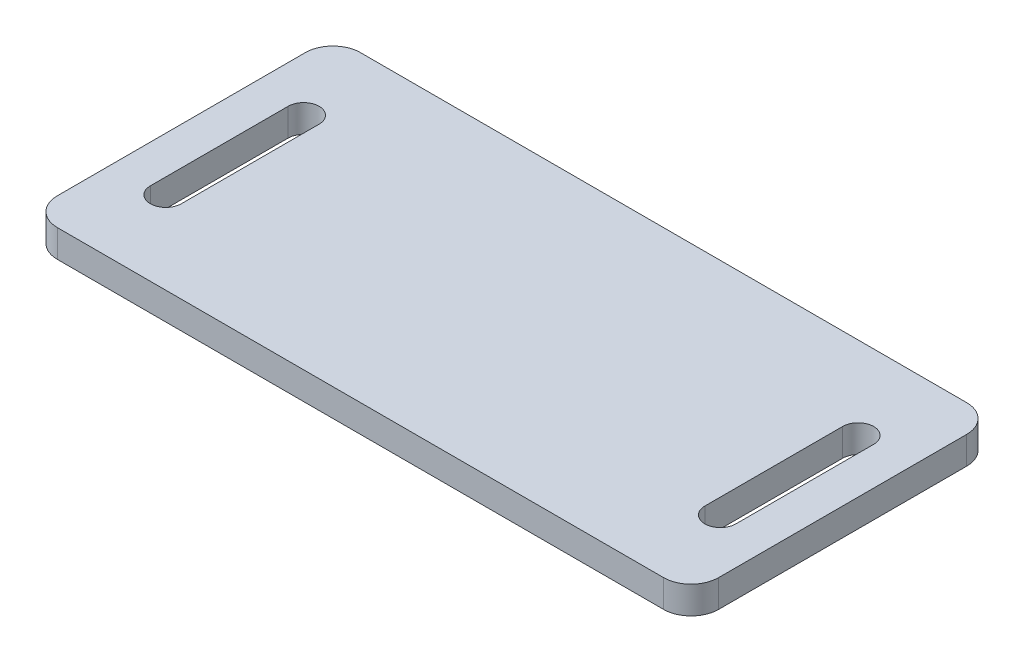
ISO-10303-21;
HEADER;
FILE_DESCRIPTION(('STEP AP214'),'2;1');
FILE_NAME('part.step','',(''),(''),'','','');
FILE_SCHEMA(('AUTOMOTIVE_DESIGN { 1 0 10303 214 1 1 1 1 }'));
ENDSEC;
DATA;
#1=APPLICATION_CONTEXT('core data for automotive mechanical design processes');
#2=APPLICATION_PROTOCOL_DEFINITION('international standard','automotive_design',2000,#1);
#3=PRODUCT_CONTEXT('',#1,'mechanical');
#4=PRODUCT('Part','Part','',(#3));
#5=PRODUCT_RELATED_PRODUCT_CATEGORY('part','',(#4));
#6=PRODUCT_DEFINITION_FORMATION('','',#4);
#7=PRODUCT_DEFINITION_CONTEXT('part definition',#1,'design');
#8=PRODUCT_DEFINITION('design','',#6,#7);
#9=PRODUCT_DEFINITION_SHAPE('','',#8);
#10=(LENGTH_UNIT() NAMED_UNIT(*) SI_UNIT(.MILLI.,.METRE.));
#11=(NAMED_UNIT(*) PLANE_ANGLE_UNIT() SI_UNIT($,.RADIAN.));
#12=(NAMED_UNIT(*) SI_UNIT($,.STERADIAN.) SOLID_ANGLE_UNIT());
#13=UNCERTAINTY_MEASURE_WITH_UNIT(LENGTH_MEASURE(1.E-05),#10,'distance_accuracy_value','');
#14=(GEOMETRIC_REPRESENTATION_CONTEXT(3) GLOBAL_UNCERTAINTY_ASSIGNED_CONTEXT((#13)) GLOBAL_UNIT_ASSIGNED_CONTEXT((#10,
#11,#12)) REPRESENTATION_CONTEXT('',''));
#15=CARTESIAN_POINT('',(0.,0.,0.));
#16=DIRECTION('',(0.,0.,1.));
#17=DIRECTION('',(1.,0.,0.));
#18=AXIS2_PLACEMENT_3D('',#15,#16,#17);
#19=CARTESIAN_POINT('',(44.,2.,-18.));
#20=DIRECTION('',(0.,-1.,0.));
#21=DIRECTION('',(0.,0.,-1.));
#22=AXIS2_PLACEMENT_3D('',#19,#20,#21);
#23=PLANE('',#22);
#24=CARTESIAN_POINT('',(-40.25,2.,-10.));
#25=DIRECTION('',(0.,1.,0.));
#26=DIRECTION('',(0.,0.,1.));
#27=AXIS2_PLACEMENT_3D('',#24,#25,#26);
#28=CIRCLE('',#27,2.25);
#29=CARTESIAN_POINT('',(-38.,2.,-10.));
#30=VERTEX_POINT('',#29);
#31=CARTESIAN_POINT('',(-42.5,2.,-10.));
#32=VERTEX_POINT('',#31);
#33=EDGE_CURVE('E204',#30,#32,#28,.T.);
#34=ORIENTED_EDGE('',*,*,#33,.F.);
#35=DIRECTION('',(0.,0.,-1.));
#36=VECTOR('',#35,1.);
#37=CARTESIAN_POINT('',(-38.,2.,-10.));
#38=LINE('',#37,#36);
#39=CARTESIAN_POINT('',(-38.,2.,10.));
#40=VERTEX_POINT('',#39);
#41=EDGE_CURVE('E212',#40,#30,#38,.T.);
#42=ORIENTED_EDGE('',*,*,#41,.F.);
#43=CARTESIAN_POINT('',(-40.25,2.,10.));
#44=DIRECTION('',(0.,1.,0.));
#45=DIRECTION('',(0.,0.,1.));
#46=AXIS2_PLACEMENT_3D('',#43,#44,#45);
#47=CIRCLE('',#46,2.25);
#48=CARTESIAN_POINT('',(-42.5,2.,10.));
#49=VERTEX_POINT('',#48);
#50=EDGE_CURVE('E209',#49,#40,#47,.T.);
#51=ORIENTED_EDGE('',*,*,#50,.F.);
#52=DIRECTION('',(0.,0.,1.));
#53=VECTOR('',#52,1.);
#54=CARTESIAN_POINT('',(-42.5,2.,-10.));
#55=LINE('',#54,#53);
#56=EDGE_CURVE('E206',#32,#49,#55,.T.);
#57=ORIENTED_EDGE('',*,*,#56,.F.);
#58=EDGE_LOOP('',(#34,#42,#51,#57));
#59=FACE_BOUND('',#58,.T.);
#60=CARTESIAN_POINT('',(44.,2.,-18.));
#61=DIRECTION('',(0.,1.,0.));
#62=DIRECTION('',(0.,0.,-1.));
#63=AXIS2_PLACEMENT_3D('',#60,#61,#62);
#64=CIRCLE('',#63,4.);
#65=CARTESIAN_POINT('',(48.,2.,-18.));
#66=VERTEX_POINT('',#65);
#67=CARTESIAN_POINT('',(44.,2.,-22.));
#68=VERTEX_POINT('',#67);
#69=EDGE_CURVE('E235',#66,#68,#64,.T.);
#70=ORIENTED_EDGE('',*,*,#69,.T.);
#71=DIRECTION('',(-1.,0.,0.));
#72=VECTOR('',#71,1.);
#73=CARTESIAN_POINT('',(-44.,2.,-22.));
#74=LINE('',#73,#72);
#75=CARTESIAN_POINT('',(-44.,2.,-22.));
#76=VERTEX_POINT('',#75);
#77=EDGE_CURVE('E239',#68,#76,#74,.T.);
#78=ORIENTED_EDGE('',*,*,#77,.T.);
#79=CARTESIAN_POINT('',(-44.,2.,-18.));
#80=DIRECTION('',(0.,1.,0.));
#81=DIRECTION('',(0.,0.,-1.));
#82=AXIS2_PLACEMENT_3D('',#79,#80,#81);
#83=CIRCLE('',#82,4.);
#84=CARTESIAN_POINT('',(-48.,2.,-18.));
#85=VERTEX_POINT('',#84);
#86=EDGE_CURVE('E243',#76,#85,#83,.T.);
#87=ORIENTED_EDGE('',*,*,#86,.T.);
#88=DIRECTION('',(0.,0.,1.));
#89=VECTOR('',#88,1.);
#90=CARTESIAN_POINT('',(-48.,2.,18.));
#91=LINE('',#90,#89);
#92=CARTESIAN_POINT('',(-48.,2.,18.));
#93=VERTEX_POINT('',#92);
#94=EDGE_CURVE('E245',#85,#93,#91,.T.);
#95=ORIENTED_EDGE('',*,*,#94,.T.);
#96=CARTESIAN_POINT('',(-44.,2.,18.));
#97=DIRECTION('',(0.,1.,0.));
#98=DIRECTION('',(0.,0.,-1.));
#99=AXIS2_PLACEMENT_3D('',#96,#97,#98);
#100=CIRCLE('',#99,4.);
#101=CARTESIAN_POINT('',(-44.,2.,22.));
#102=VERTEX_POINT('',#101);
#103=EDGE_CURVE('E247',#93,#102,#100,.T.);
#104=ORIENTED_EDGE('',*,*,#103,.T.);
#105=DIRECTION('',(1.,0.,0.));
#106=VECTOR('',#105,1.);
#107=CARTESIAN_POINT('',(-44.,2.,22.));
#108=LINE('',#107,#106);
#109=CARTESIAN_POINT('',(44.,2.,22.));
#110=VERTEX_POINT('',#109);
#111=EDGE_CURVE('E249',#102,#110,#108,.T.);
#112=ORIENTED_EDGE('',*,*,#111,.T.);
#113=CARTESIAN_POINT('',(44.,2.,18.));
#114=DIRECTION('',(0.,1.,0.));
#115=DIRECTION('',(0.,0.,1.));
#116=AXIS2_PLACEMENT_3D('',#113,#114,#115);
#117=CIRCLE('',#116,4.);
#118=CARTESIAN_POINT('',(48.,2.,18.));
#119=VERTEX_POINT('',#118);
#120=EDGE_CURVE('E251',#110,#119,#117,.T.);
#121=ORIENTED_EDGE('',*,*,#120,.T.);
#122=DIRECTION('',(0.,0.,-1.));
#123=VECTOR('',#122,1.);
#124=CARTESIAN_POINT('',(48.,2.,18.));
#125=LINE('',#124,#123);
#126=EDGE_CURVE('E253',#119,#66,#125,.T.);
#127=ORIENTED_EDGE('',*,*,#126,.T.);
#128=EDGE_LOOP('',(#70,#78,#87,#95,#104,#112,#121,#127));
#129=FACE_BOUND('',#128,.T.);
#130=CARTESIAN_POINT('',(40.25,2.,-10.));
#131=DIRECTION('',(0.,1.,0.));
#132=DIRECTION('',(0.,0.,1.));
#133=AXIS2_PLACEMENT_3D('',#130,#131,#132);
#134=CIRCLE('',#133,2.25);
#135=CARTESIAN_POINT('',(42.5,2.,-10.));
#136=VERTEX_POINT('',#135);
#137=CARTESIAN_POINT('',(38.,2.,-10.));
#138=VERTEX_POINT('',#137);
#139=EDGE_CURVE('E160',#136,#138,#134,.T.);
#140=ORIENTED_EDGE('',*,*,#139,.F.);
#141=DIRECTION('',(0.,0.,-1.));
#142=VECTOR('',#141,1.);
#143=CARTESIAN_POINT('',(42.5,2.,-10.));
#144=LINE('',#143,#142);
#145=CARTESIAN_POINT('',(42.5,2.,10.));
#146=VERTEX_POINT('',#145);
#147=EDGE_CURVE('E185',#146,#136,#144,.T.);
#148=ORIENTED_EDGE('',*,*,#147,.F.);
#149=CARTESIAN_POINT('',(40.25,2.,10.));
#150=DIRECTION('',(0.,1.,0.));
#151=DIRECTION('',(0.,0.,1.));
#152=AXIS2_PLACEMENT_3D('',#149,#150,#151);
#153=CIRCLE('',#152,2.25);
#154=CARTESIAN_POINT('',(38.,2.,10.));
#155=VERTEX_POINT('',#154);
#156=EDGE_CURVE('E182',#155,#146,#153,.T.);
#157=ORIENTED_EDGE('',*,*,#156,.F.);
#158=DIRECTION('',(0.,0.,1.));
#159=VECTOR('',#158,1.);
#160=CARTESIAN_POINT('',(38.,2.,-10.));
#161=LINE('',#160,#159);
#162=EDGE_CURVE('E169',#138,#155,#161,.T.);
#163=ORIENTED_EDGE('',*,*,#162,.F.);
#164=EDGE_LOOP('',(#140,#148,#157,#163));
#165=FACE_BOUND('',#164,.T.);
#166=ADVANCED_FACE('F38',(#59,#129,#165),#23,.F.);
#167=CARTESIAN_POINT('',(44.,-2.,-18.));
#168=DIRECTION('',(0.,-1.,0.));
#169=DIRECTION('',(0.,0.,-1.));
#170=AXIS2_PLACEMENT_3D('',#167,#168,#169);
#171=PLANE('',#170);
#172=CARTESIAN_POINT('',(44.,-2.,-18.));
#173=DIRECTION('',(0.,1.,0.));
#174=DIRECTION('',(0.,0.,-1.));
#175=AXIS2_PLACEMENT_3D('',#172,#173,#174);
#176=CIRCLE('',#175,4.);
#177=CARTESIAN_POINT('',(48.,-2.,-18.));
#178=VERTEX_POINT('',#177);
#179=CARTESIAN_POINT('',(44.,-2.,-22.));
#180=VERTEX_POINT('',#179);
#181=EDGE_CURVE('E234',#178,#180,#176,.T.);
#182=ORIENTED_EDGE('',*,*,#181,.F.);
#183=DIRECTION('',(0.,0.,-1.));
#184=VECTOR('',#183,1.);
#185=CARTESIAN_POINT('',(48.,-2.,18.));
#186=LINE('',#185,#184);
#187=CARTESIAN_POINT('',(48.,-2.,18.));
#188=VERTEX_POINT('',#187);
#189=EDGE_CURVE('E240',#188,#178,#186,.T.);
#190=ORIENTED_EDGE('',*,*,#189,.F.);
#191=CARTESIAN_POINT('',(44.,-2.,18.));
#192=DIRECTION('',(0.,1.,0.));
#193=DIRECTION('',(0.,0.,1.));
#194=AXIS2_PLACEMENT_3D('',#191,#192,#193);
#195=CIRCLE('',#194,4.);
#196=CARTESIAN_POINT('',(44.,-2.,22.));
#197=VERTEX_POINT('',#196);
#198=EDGE_CURVE('E271',#197,#188,#195,.T.);
#199=ORIENTED_EDGE('',*,*,#198,.F.);
#200=DIRECTION('',(1.,0.,0.));
#201=VECTOR('',#200,1.);
#202=CARTESIAN_POINT('',(-44.,-2.,22.));
#203=LINE('',#202,#201);
#204=CARTESIAN_POINT('',(-44.,-2.,22.));
#205=VERTEX_POINT('',#204);
#206=EDGE_CURVE('E269',#205,#197,#203,.T.);
#207=ORIENTED_EDGE('',*,*,#206,.F.);
#208=CARTESIAN_POINT('',(-44.,-2.,18.));
#209=DIRECTION('',(0.,1.,0.));
#210=DIRECTION('',(0.,0.,-1.));
#211=AXIS2_PLACEMENT_3D('',#208,#209,#210);
#212=CIRCLE('',#211,4.);
#213=CARTESIAN_POINT('',(-48.,-2.,18.));
#214=VERTEX_POINT('',#213);
#215=EDGE_CURVE('E267',#214,#205,#212,.T.);
#216=ORIENTED_EDGE('',*,*,#215,.F.);
#217=DIRECTION('',(0.,0.,1.));
#218=VECTOR('',#217,1.);
#219=CARTESIAN_POINT('',(-48.,-2.,18.));
#220=LINE('',#219,#218);
#221=CARTESIAN_POINT('',(-48.,-2.,-18.));
#222=VERTEX_POINT('',#221);
#223=EDGE_CURVE('E265',#222,#214,#220,.T.);
#224=ORIENTED_EDGE('',*,*,#223,.F.);
#225=CARTESIAN_POINT('',(-44.,-2.,-18.));
#226=DIRECTION('',(0.,1.,0.));
#227=DIRECTION('',(0.,0.,-1.));
#228=AXIS2_PLACEMENT_3D('',#225,#226,#227);
#229=CIRCLE('',#228,4.);
#230=CARTESIAN_POINT('',(-44.,-2.,-22.));
#231=VERTEX_POINT('',#230);
#232=EDGE_CURVE('E263',#231,#222,#229,.T.);
#233=ORIENTED_EDGE('',*,*,#232,.F.);
#234=DIRECTION('',(-1.,0.,0.));
#235=VECTOR('',#234,1.);
#236=CARTESIAN_POINT('',(-44.,-2.,-22.));
#237=LINE('',#236,#235);
#238=EDGE_CURVE('E260',#180,#231,#237,.T.);
#239=ORIENTED_EDGE('',*,*,#238,.F.);
#240=EDGE_LOOP('',(#182,#190,#199,#207,#216,#224,#233,#239));
#241=FACE_BOUND('',#240,.T.);
#242=DIRECTION('',(0.,0.,-1.));
#243=VECTOR('',#242,1.);
#244=CARTESIAN_POINT('',(-38.,-2.,-10.));
#245=LINE('',#244,#243);
#246=CARTESIAN_POINT('',(-38.,-2.,10.));
#247=VERTEX_POINT('',#246);
#248=CARTESIAN_POINT('',(-38.,-2.,-10.));
#249=VERTEX_POINT('',#248);
#250=EDGE_CURVE('E207',#247,#249,#245,.T.);
#251=ORIENTED_EDGE('',*,*,#250,.T.);
#252=CARTESIAN_POINT('',(-40.25,-2.,-10.));
#253=DIRECTION('',(0.,1.,0.));
#254=DIRECTION('',(0.,0.,1.));
#255=AXIS2_PLACEMENT_3D('',#252,#253,#254);
#256=CIRCLE('',#255,2.25);
#257=CARTESIAN_POINT('',(-42.5,-2.,-10.));
#258=VERTEX_POINT('',#257);
#259=EDGE_CURVE('E178',#249,#258,#256,.T.);
#260=ORIENTED_EDGE('',*,*,#259,.T.);
#261=DIRECTION('',(0.,0.,1.));
#262=VECTOR('',#261,1.);
#263=CARTESIAN_POINT('',(-42.5,-2.,-10.));
#264=LINE('',#263,#262);
#265=CARTESIAN_POINT('',(-42.5,-2.,10.));
#266=VERTEX_POINT('',#265);
#267=EDGE_CURVE('E217',#258,#266,#264,.T.);
#268=ORIENTED_EDGE('',*,*,#267,.T.);
#269=CARTESIAN_POINT('',(-40.25,-2.,10.));
#270=DIRECTION('',(0.,1.,0.));
#271=DIRECTION('',(0.,0.,1.));
#272=AXIS2_PLACEMENT_3D('',#269,#270,#271);
#273=CIRCLE('',#272,2.25);
#274=EDGE_CURVE('E220',#266,#247,#273,.T.);
#275=ORIENTED_EDGE('',*,*,#274,.T.);
#276=EDGE_LOOP('',(#251,#260,#268,#275));
#277=FACE_BOUND('',#276,.T.);
#278=DIRECTION('',(0.,0.,-1.));
#279=VECTOR('',#278,1.);
#280=CARTESIAN_POINT('',(42.5,-2.,-10.));
#281=LINE('',#280,#279);
#282=CARTESIAN_POINT('',(42.5,-2.,10.));
#283=VERTEX_POINT('',#282);
#284=CARTESIAN_POINT('',(42.5,-2.,-10.));
#285=VERTEX_POINT('',#284);
#286=EDGE_CURVE('E170',#283,#285,#281,.T.);
#287=ORIENTED_EDGE('',*,*,#286,.T.);
#288=CARTESIAN_POINT('',(40.25,-2.,-10.));
#289=DIRECTION('',(0.,1.,0.));
#290=DIRECTION('',(0.,0.,1.));
#291=AXIS2_PLACEMENT_3D('',#288,#289,#290);
#292=CIRCLE('',#291,2.25);
#293=CARTESIAN_POINT('',(38.,-2.,-10.));
#294=VERTEX_POINT('',#293);
#295=EDGE_CURVE('E65',#285,#294,#292,.T.);
#296=ORIENTED_EDGE('',*,*,#295,.T.);
#297=DIRECTION('',(0.,0.,1.));
#298=VECTOR('',#297,1.);
#299=CARTESIAN_POINT('',(38.,-2.,-10.));
#300=LINE('',#299,#298);
#301=CARTESIAN_POINT('',(38.,-2.,10.));
#302=VERTEX_POINT('',#301);
#303=EDGE_CURVE('E176',#294,#302,#300,.T.);
#304=ORIENTED_EDGE('',*,*,#303,.T.);
#305=CARTESIAN_POINT('',(40.25,-2.,10.));
#306=DIRECTION('',(0.,1.,0.));
#307=DIRECTION('',(0.,0.,1.));
#308=AXIS2_PLACEMENT_3D('',#305,#306,#307);
#309=CIRCLE('',#308,2.25);
#310=EDGE_CURVE('E194',#302,#283,#309,.T.);
#311=ORIENTED_EDGE('',*,*,#310,.T.);
#312=EDGE_LOOP('',(#287,#296,#304,#311));
#313=FACE_BOUND('',#312,.T.);
#314=ADVANCED_FACE('F303',(#241,#277,#313),#171,.T.);
#315=CARTESIAN_POINT('',(44.,2.,-18.));
#316=DIRECTION('',(0.,-1.,0.));
#317=DIRECTION('',(0.,0.,-1.));
#318=AXIS2_PLACEMENT_3D('',#315,#316,#317);
#319=CYLINDRICAL_SURFACE('',#318,4.);
#320=ORIENTED_EDGE('',*,*,#181,.T.);
#321=DIRECTION('',(0.,-1.,0.));
#322=VECTOR('',#321,1.);
#323=CARTESIAN_POINT('',(44.,2.,-22.));
#324=LINE('',#323,#322);
#325=EDGE_CURVE('E11',#68,#180,#324,.T.);
#326=ORIENTED_EDGE('',*,*,#325,.F.);
#327=ORIENTED_EDGE('',*,*,#69,.F.);
#328=DIRECTION('',(0.,-1.,0.));
#329=VECTOR('',#328,1.);
#330=CARTESIAN_POINT('',(48.,2.,-18.));
#331=LINE('',#330,#329);
#332=EDGE_CURVE('E256',#66,#178,#331,.T.);
#333=ORIENTED_EDGE('',*,*,#332,.T.);
#334=EDGE_LOOP('',(#320,#326,#327,#333));
#335=FACE_BOUND('',#334,.T.);
#336=ADVANCED_FACE('F40',(#335),#319,.T.);
#337=CARTESIAN_POINT('',(-44.,2.,-22.));
#338=DIRECTION('',(0.,0.,1.));
#339=DIRECTION('',(1.,0.,0.));
#340=AXIS2_PLACEMENT_3D('',#337,#338,#339);
#341=PLANE('',#340);
#342=ORIENTED_EDGE('',*,*,#238,.T.);
#343=DIRECTION('',(0.,-1.,0.));
#344=VECTOR('',#343,1.);
#345=CARTESIAN_POINT('',(-44.,2.,-22.));
#346=LINE('',#345,#344);
#347=EDGE_CURVE('E47',#76,#231,#346,.T.);
#348=ORIENTED_EDGE('',*,*,#347,.F.);
#349=ORIENTED_EDGE('',*,*,#77,.F.);
#350=ORIENTED_EDGE('',*,*,#325,.T.);
#351=EDGE_LOOP('',(#342,#348,#349,#350));
#352=FACE_BOUND('',#351,.T.);
#353=ADVANCED_FACE('F320',(#352),#341,.F.);
#354=CARTESIAN_POINT('',(-44.,2.,-18.));
#355=DIRECTION('',(0.,-1.,0.));
#356=DIRECTION('',(0.,0.,-1.));
#357=AXIS2_PLACEMENT_3D('',#354,#355,#356);
#358=CYLINDRICAL_SURFACE('',#357,4.);
#359=ORIENTED_EDGE('',*,*,#232,.T.);
#360=DIRECTION('',(0.,-1.,0.));
#361=VECTOR('',#360,1.);
#362=CARTESIAN_POINT('',(-48.,2.,-18.));
#363=LINE('',#362,#361);
#364=EDGE_CURVE('E290',#85,#222,#363,.T.);
#365=ORIENTED_EDGE('',*,*,#364,.F.);
#366=ORIENTED_EDGE('',*,*,#86,.F.);
#367=ORIENTED_EDGE('',*,*,#347,.T.);
#368=EDGE_LOOP('',(#359,#365,#366,#367));
#369=FACE_BOUND('',#368,.T.);
#370=ADVANCED_FACE('F297',(#369),#358,.T.);
#371=CARTESIAN_POINT('',(-48.,2.,18.));
#372=DIRECTION('',(1.,0.,0.));
#373=DIRECTION('',(0.,0.,-1.));
#374=AXIS2_PLACEMENT_3D('',#371,#372,#373);
#375=PLANE('',#374);
#376=ORIENTED_EDGE('',*,*,#223,.T.);
#377=DIRECTION('',(0.,-1.,0.));
#378=VECTOR('',#377,1.);
#379=CARTESIAN_POINT('',(-48.,2.,18.));
#380=LINE('',#379,#378);
#381=EDGE_CURVE('E287',#93,#214,#380,.T.);
#382=ORIENTED_EDGE('',*,*,#381,.F.);
#383=ORIENTED_EDGE('',*,*,#94,.F.);
#384=ORIENTED_EDGE('',*,*,#364,.T.);
#385=EDGE_LOOP('',(#376,#382,#383,#384));
#386=FACE_BOUND('',#385,.T.);
#387=ADVANCED_FACE('F309',(#386),#375,.F.);
#388=CARTESIAN_POINT('',(-44.,2.,18.));
#389=DIRECTION('',(0.,-1.,0.));
#390=DIRECTION('',(0.,0.,-1.));
#391=AXIS2_PLACEMENT_3D('',#388,#389,#390);
#392=CYLINDRICAL_SURFACE('',#391,4.);
#393=ORIENTED_EDGE('',*,*,#215,.T.);
#394=DIRECTION('',(0.,-1.,0.));
#395=VECTOR('',#394,1.);
#396=CARTESIAN_POINT('',(-44.,2.,22.));
#397=LINE('',#396,#395);
#398=EDGE_CURVE('E284',#102,#205,#397,.T.);
#399=ORIENTED_EDGE('',*,*,#398,.F.);
#400=ORIENTED_EDGE('',*,*,#103,.F.);
#401=ORIENTED_EDGE('',*,*,#381,.T.);
#402=EDGE_LOOP('',(#393,#399,#400,#401));
#403=FACE_BOUND('',#402,.T.);
#404=ADVANCED_FACE('F313',(#403),#392,.T.);
#405=CARTESIAN_POINT('',(-44.,2.,22.));
#406=DIRECTION('',(0.,0.,-1.));
#407=DIRECTION('',(-1.,0.,0.));
#408=AXIS2_PLACEMENT_3D('',#405,#406,#407);
#409=PLANE('',#408);
#410=ORIENTED_EDGE('',*,*,#206,.T.);
#411=DIRECTION('',(0.,-1.,0.));
#412=VECTOR('',#411,1.);
#413=CARTESIAN_POINT('',(44.,2.,22.));
#414=LINE('',#413,#412);
#415=EDGE_CURVE('E281',#110,#197,#414,.T.);
#416=ORIENTED_EDGE('',*,*,#415,.F.);
#417=ORIENTED_EDGE('',*,*,#111,.F.);
#418=ORIENTED_EDGE('',*,*,#398,.T.);
#419=EDGE_LOOP('',(#410,#416,#417,#418));
#420=FACE_BOUND('',#419,.T.);
#421=ADVANCED_FACE('F333',(#420),#409,.F.);
#422=CARTESIAN_POINT('',(44.,2.,18.));
#423=DIRECTION('',(0.,-1.,0.));
#424=DIRECTION('',(0.,0.,-1.));
#425=AXIS2_PLACEMENT_3D('',#422,#423,#424);
#426=CYLINDRICAL_SURFACE('',#425,4.);
#427=ORIENTED_EDGE('',*,*,#198,.T.);
#428=DIRECTION('',(0.,-1.,0.));
#429=VECTOR('',#428,1.);
#430=CARTESIAN_POINT('',(48.,2.,18.));
#431=LINE('',#430,#429);
#432=EDGE_CURVE('E278',#119,#188,#431,.T.);
#433=ORIENTED_EDGE('',*,*,#432,.F.);
#434=ORIENTED_EDGE('',*,*,#120,.F.);
#435=ORIENTED_EDGE('',*,*,#415,.T.);
#436=EDGE_LOOP('',(#427,#433,#434,#435));
#437=FACE_BOUND('',#436,.T.);
#438=ADVANCED_FACE('F331',(#437),#426,.T.);
#439=CARTESIAN_POINT('',(48.,2.,18.));
#440=DIRECTION('',(-1.,0.,0.));
#441=DIRECTION('',(0.,0.,1.));
#442=AXIS2_PLACEMENT_3D('',#439,#440,#441);
#443=PLANE('',#442);
#444=ORIENTED_EDGE('',*,*,#189,.T.);
#445=ORIENTED_EDGE('',*,*,#332,.F.);
#446=ORIENTED_EDGE('',*,*,#126,.F.);
#447=ORIENTED_EDGE('',*,*,#432,.T.);
#448=EDGE_LOOP('',(#444,#445,#446,#447));
#449=FACE_BOUND('',#448,.T.);
#450=ADVANCED_FACE('F326',(#449),#443,.F.);
#451=CARTESIAN_POINT('',(-40.25,2.,-10.));
#452=DIRECTION('',(0.,-1.,0.));
#453=DIRECTION('',(0.,0.,-1.));
#454=AXIS2_PLACEMENT_3D('',#451,#452,#453);
#455=CYLINDRICAL_SURFACE('',#454,2.25);
#456=ORIENTED_EDGE('',*,*,#259,.F.);
#457=DIRECTION('',(0.,-1.,0.));
#458=VECTOR('',#457,1.);
#459=CARTESIAN_POINT('',(-38.,2.,-10.));
#460=LINE('',#459,#458);
#461=EDGE_CURVE('E214',#30,#249,#460,.T.);
#462=ORIENTED_EDGE('',*,*,#461,.F.);
#463=ORIENTED_EDGE('',*,*,#33,.T.);
#464=DIRECTION('',(0.,-1.,0.));
#465=VECTOR('',#464,1.);
#466=CARTESIAN_POINT('',(-42.5,2.,-10.));
#467=LINE('',#466,#465);
#468=EDGE_CURVE('E231',#32,#258,#467,.T.);
#469=ORIENTED_EDGE('',*,*,#468,.T.);
#470=EDGE_LOOP('',(#456,#462,#463,#469));
#471=FACE_BOUND('',#470,.T.);
#472=ADVANCED_FACE('F351',(#471),#455,.F.);
#473=CARTESIAN_POINT('',(-42.5,2.,-10.));
#474=DIRECTION('',(1.,0.,0.));
#475=DIRECTION('',(0.,0.,-1.));
#476=AXIS2_PLACEMENT_3D('',#473,#474,#475);
#477=PLANE('',#476);
#478=ORIENTED_EDGE('',*,*,#267,.F.);
#479=ORIENTED_EDGE('',*,*,#468,.F.);
#480=ORIENTED_EDGE('',*,*,#56,.T.);
#481=DIRECTION('',(0.,-1.,0.));
#482=VECTOR('',#481,1.);
#483=CARTESIAN_POINT('',(-42.5,2.,10.));
#484=LINE('',#483,#482);
#485=EDGE_CURVE('E229',#49,#266,#484,.T.);
#486=ORIENTED_EDGE('',*,*,#485,.T.);
#487=EDGE_LOOP('',(#478,#479,#480,#486));
#488=FACE_BOUND('',#487,.T.);
#489=ADVANCED_FACE('F358',(#488),#477,.T.);
#490=CARTESIAN_POINT('',(-40.25,2.,10.));
#491=DIRECTION('',(0.,-1.,0.));
#492=DIRECTION('',(0.,0.,-1.));
#493=AXIS2_PLACEMENT_3D('',#490,#491,#492);
#494=CYLINDRICAL_SURFACE('',#493,2.25);
#495=ORIENTED_EDGE('',*,*,#274,.F.);
#496=ORIENTED_EDGE('',*,*,#485,.F.);
#497=ORIENTED_EDGE('',*,*,#50,.T.);
#498=DIRECTION('',(0.,-1.,0.));
#499=VECTOR('',#498,1.);
#500=CARTESIAN_POINT('',(-38.,2.,10.));
#501=LINE('',#500,#499);
#502=EDGE_CURVE('E227',#40,#247,#501,.T.);
#503=ORIENTED_EDGE('',*,*,#502,.T.);
#504=EDGE_LOOP('',(#495,#496,#497,#503));
#505=FACE_BOUND('',#504,.T.);
#506=ADVANCED_FACE('F363',(#505),#494,.F.);
#507=CARTESIAN_POINT('',(-38.,2.,-10.));
#508=DIRECTION('',(-1.,0.,0.));
#509=DIRECTION('',(0.,0.,1.));
#510=AXIS2_PLACEMENT_3D('',#507,#508,#509);
#511=PLANE('',#510);
#512=ORIENTED_EDGE('',*,*,#250,.F.);
#513=ORIENTED_EDGE('',*,*,#502,.F.);
#514=ORIENTED_EDGE('',*,*,#41,.T.);
#515=ORIENTED_EDGE('',*,*,#461,.T.);
#516=EDGE_LOOP('',(#512,#513,#514,#515));
#517=FACE_BOUND('',#516,.T.);
#518=ADVANCED_FACE('F369',(#517),#511,.T.);
#519=CARTESIAN_POINT('',(40.25,2.,-10.));
#520=DIRECTION('',(0.,-1.,0.));
#521=DIRECTION('',(0.,0.,-1.));
#522=AXIS2_PLACEMENT_3D('',#519,#520,#521);
#523=CYLINDRICAL_SURFACE('',#522,2.25);
#524=ORIENTED_EDGE('',*,*,#295,.F.);
#525=DIRECTION('',(0.,-1.,0.));
#526=VECTOR('',#525,1.);
#527=CARTESIAN_POINT('',(42.5,2.,-10.));
#528=LINE('',#527,#526);
#529=EDGE_CURVE('E164',#136,#285,#528,.T.);
#530=ORIENTED_EDGE('',*,*,#529,.F.);
#531=ORIENTED_EDGE('',*,*,#139,.T.);
#532=DIRECTION('',(0.,-1.,0.));
#533=VECTOR('',#532,1.);
#534=CARTESIAN_POINT('',(38.,2.,-10.));
#535=LINE('',#534,#533);
#536=EDGE_CURVE('E163',#138,#294,#535,.T.);
#537=ORIENTED_EDGE('',*,*,#536,.T.);
#538=EDGE_LOOP('',(#524,#530,#531,#537));
#539=FACE_BOUND('',#538,.T.);
#540=ADVANCED_FACE('F162',(#539),#523,.F.);
#541=CARTESIAN_POINT('',(38.,2.,-10.));
#542=DIRECTION('',(1.,0.,0.));
#543=DIRECTION('',(0.,0.,-1.));
#544=AXIS2_PLACEMENT_3D('',#541,#542,#543);
#545=PLANE('',#544);
#546=ORIENTED_EDGE('',*,*,#303,.F.);
#547=ORIENTED_EDGE('',*,*,#536,.F.);
#548=ORIENTED_EDGE('',*,*,#162,.T.);
#549=DIRECTION('',(0.,-1.,0.));
#550=VECTOR('',#549,1.);
#551=CARTESIAN_POINT('',(38.,2.,10.));
#552=LINE('',#551,#550);
#553=EDGE_CURVE('E179',#155,#302,#552,.T.);
#554=ORIENTED_EDGE('',*,*,#553,.T.);
#555=EDGE_LOOP('',(#546,#547,#548,#554));
#556=FACE_BOUND('',#555,.T.);
#557=ADVANCED_FACE('F173',(#556),#545,.T.);
#558=CARTESIAN_POINT('',(40.25,2.,10.));
#559=DIRECTION('',(0.,-1.,0.));
#560=DIRECTION('',(0.,0.,-1.));
#561=AXIS2_PLACEMENT_3D('',#558,#559,#560);
#562=CYLINDRICAL_SURFACE('',#561,2.25);
#563=ORIENTED_EDGE('',*,*,#310,.F.);
#564=ORIENTED_EDGE('',*,*,#553,.F.);
#565=ORIENTED_EDGE('',*,*,#156,.T.);
#566=DIRECTION('',(0.,-1.,0.));
#567=VECTOR('',#566,1.);
#568=CARTESIAN_POINT('',(42.5,2.,10.));
#569=LINE('',#568,#567);
#570=EDGE_CURVE('E54',#146,#283,#569,.T.);
#571=ORIENTED_EDGE('',*,*,#570,.T.);
#572=EDGE_LOOP('',(#563,#564,#565,#571));
#573=FACE_BOUND('',#572,.T.);
#574=ADVANCED_FACE('F388',(#573),#562,.F.);
#575=CARTESIAN_POINT('',(42.5,2.,-10.));
#576=DIRECTION('',(-1.,0.,0.));
#577=DIRECTION('',(0.,0.,1.));
#578=AXIS2_PLACEMENT_3D('',#575,#576,#577);
#579=PLANE('',#578);
#580=ORIENTED_EDGE('',*,*,#286,.F.);
#581=ORIENTED_EDGE('',*,*,#570,.F.);
#582=ORIENTED_EDGE('',*,*,#147,.T.);
#583=ORIENTED_EDGE('',*,*,#529,.T.);
#584=EDGE_LOOP('',(#580,#581,#582,#583));
#585=FACE_BOUND('',#584,.T.);
#586=ADVANCED_FACE('F391',(#585),#579,.T.);
#587=CLOSED_SHELL('',(#166,#314,#336,#353,#370,#387,#404,#421,#438,#450,#472,#489,#506,#518,
#540,#557,#574,#586));
#588=MANIFOLD_SOLID_BREP('B2',#587);
#589=ADVANCED_BREP_SHAPE_REPRESENTATION('',(#18,#588),#14);
#590=SHAPE_DEFINITION_REPRESENTATION(#9,#589);
ENDSEC;
END-ISO-10303-21;
